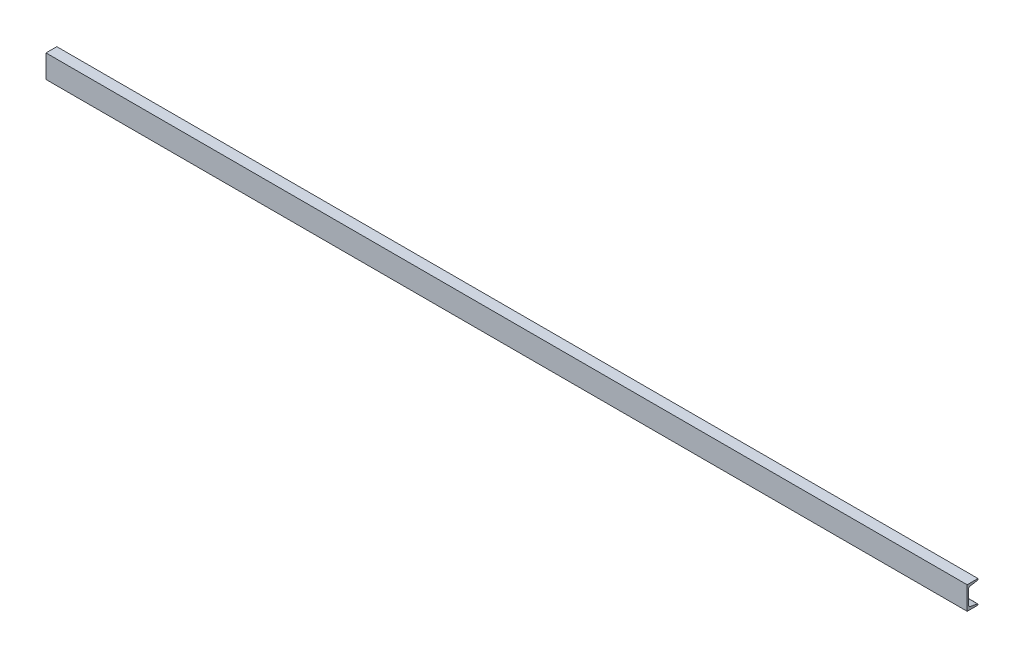
ISO-10303-21;
HEADER;
FILE_DESCRIPTION(('STEP AP214'),'2;1');
FILE_NAME('part.step','',(''),(''),'','','');
FILE_SCHEMA(('AUTOMOTIVE_DESIGN { 1 0 10303 214 1 1 1 1 }'));
ENDSEC;
DATA;
#1=APPLICATION_CONTEXT('core data for automotive mechanical design processes');
#2=APPLICATION_PROTOCOL_DEFINITION('international standard','automotive_design',2000,#1);
#3=PRODUCT_CONTEXT('',#1,'mechanical');
#4=PRODUCT('Part','Part','',(#3));
#5=PRODUCT_RELATED_PRODUCT_CATEGORY('part','',(#4));
#6=PRODUCT_DEFINITION_FORMATION('','',#4);
#7=PRODUCT_DEFINITION_CONTEXT('part definition',#1,'design');
#8=PRODUCT_DEFINITION('design','',#6,#7);
#9=PRODUCT_DEFINITION_SHAPE('','',#8);
#10=(LENGTH_UNIT() NAMED_UNIT(*) SI_UNIT(.MILLI.,.METRE.));
#11=(NAMED_UNIT(*) PLANE_ANGLE_UNIT() SI_UNIT($,.RADIAN.));
#12=(NAMED_UNIT(*) SI_UNIT($,.STERADIAN.) SOLID_ANGLE_UNIT());
#13=UNCERTAINTY_MEASURE_WITH_UNIT(LENGTH_MEASURE(1.E-05),#10,'distance_accuracy_value','');
#14=(GEOMETRIC_REPRESENTATION_CONTEXT(3) GLOBAL_UNCERTAINTY_ASSIGNED_CONTEXT((#13)) GLOBAL_UNIT_ASSIGNED_CONTEXT((#10,
#11,#12)) REPRESENTATION_CONTEXT('',''));
#15=CARTESIAN_POINT('',(0.,0.,0.));
#16=DIRECTION('',(0.,0.,1.));
#17=DIRECTION('',(1.,0.,0.));
#18=AXIS2_PLACEMENT_3D('',#15,#16,#17);
#19=CARTESIAN_POINT('',(3048.,-38.1,0.));
#20=DIRECTION('',(0.,1.,0.));
#21=DIRECTION('',(0.,0.,1.));
#22=AXIS2_PLACEMENT_3D('',#19,#20,#21);
#23=PLANE('',#22);
#24=DIRECTION('',(0.,0.,-1.));
#25=VECTOR('',#24,1.);
#26=CARTESIAN_POINT('',(0.,-38.1,0.));
#27=LINE('',#26,#25);
#28=CARTESIAN_POINT('',(0.,-38.1,0.));
#29=VERTEX_POINT('',#28);
#30=CARTESIAN_POINT('',(0.,-38.1,-35.814));
#31=VERTEX_POINT('',#30);
#32=EDGE_CURVE('E194',#29,#31,#27,.T.);
#33=ORIENTED_EDGE('',*,*,#32,.T.);
#34=DIRECTION('',(-1.,0.,0.));
#35=VECTOR('',#34,1.);
#36=CARTESIAN_POINT('',(3048.,-38.1,-35.814));
#37=LINE('',#36,#35);
#38=CARTESIAN_POINT('',(3048.,-38.1,-35.814));
#39=VERTEX_POINT('',#38);
#40=EDGE_CURVE('E13',#39,#31,#37,.T.);
#41=ORIENTED_EDGE('',*,*,#40,.F.);
#42=DIRECTION('',(0.,0.,-1.));
#43=VECTOR('',#42,1.);
#44=CARTESIAN_POINT('',(3048.,-38.1,0.));
#45=LINE('',#44,#43);
#46=CARTESIAN_POINT('',(3048.,-38.1,0.));
#47=VERTEX_POINT('',#46);
#48=EDGE_CURVE('E216',#47,#39,#45,.T.);
#49=ORIENTED_EDGE('',*,*,#48,.F.);
#50=DIRECTION('',(-1.,0.,0.));
#51=VECTOR('',#50,1.);
#52=CARTESIAN_POINT('',(3048.,-38.1,0.));
#53=LINE('',#52,#51);
#54=EDGE_CURVE('E190',#47,#29,#53,.T.);
#55=ORIENTED_EDGE('',*,*,#54,.T.);
#56=EDGE_LOOP('',(#33,#41,#49,#55));
#57=FACE_BOUND('',#56,.T.);
#58=ADVANCED_FACE('F74',(#57),#23,.F.);
#59=CARTESIAN_POINT('',(3048.,-38.1,-35.814));
#60=DIRECTION('',(0.,0.,1.));
#61=DIRECTION('',(1.,0.,0.));
#62=AXIS2_PLACEMENT_3D('',#59,#60,#61);
#63=PLANE('',#62);
#64=DIRECTION('',(0.,1.,0.));
#65=VECTOR('',#64,1.);
#66=CARTESIAN_POINT('',(0.,-38.1,-35.814));
#67=LINE('',#66,#65);
#68=CARTESIAN_POINT('',(0.,-35.942335135838,-35.814));
#69=VERTEX_POINT('',#68);
#70=EDGE_CURVE('E197',#31,#69,#67,.T.);
#71=ORIENTED_EDGE('',*,*,#70,.T.);
#72=DIRECTION('',(-1.,0.,0.));
#73=VECTOR('',#72,1.);
#74=CARTESIAN_POINT('',(3048.,-35.942335135838,-35.814));
#75=LINE('',#74,#73);
#76=CARTESIAN_POINT('',(3048.,-35.942335135838,-35.814));
#77=VERTEX_POINT('',#76);
#78=EDGE_CURVE('E82',#77,#69,#75,.T.);
#79=ORIENTED_EDGE('',*,*,#78,.F.);
#80=DIRECTION('',(0.,1.,0.));
#81=VECTOR('',#80,1.);
#82=CARTESIAN_POINT('',(3048.,-38.1,-35.814));
#83=LINE('',#82,#81);
#84=EDGE_CURVE('E145',#39,#77,#83,.T.);
#85=ORIENTED_EDGE('',*,*,#84,.F.);
#86=ORIENTED_EDGE('',*,*,#40,.T.);
#87=EDGE_LOOP('',(#71,#79,#85,#86));
#88=FACE_BOUND('',#87,.T.);
#89=ADVANCED_FACE('F294',(#88),#63,.F.);
#90=CARTESIAN_POINT('',(3048.,-35.942335135838,-33.274));
#91=DIRECTION('',(-1.,0.,0.));
#92=DIRECTION('',(0.,0.,1.));
#93=AXIS2_PLACEMENT_3D('',#90,#91,#92);
#94=CYLINDRICAL_SURFACE('',#93,2.54);
#95=CARTESIAN_POINT('',(0.,-35.942335135838,-33.274));
#96=DIRECTION('',(1.,0.,0.));
#97=DIRECTION('',(0.,0.,-1.));
#98=AXIS2_PLACEMENT_3D('',#95,#96,#97);
#99=CIRCLE('',#98,2.54);
#100=CARTESIAN_POINT('',(0.,-33.4368995092487,-33.6916030663407));
#101=VERTEX_POINT('',#100);
#102=EDGE_CURVE('E199',#69,#101,#99,.T.);
#103=ORIENTED_EDGE('',*,*,#102,.T.);
#104=DIRECTION('',(-1.,0.,0.));
#105=VECTOR('',#104,1.);
#106=CARTESIAN_POINT('',(3048.,-33.4368995092487,-33.6916030663407));
#107=LINE('',#106,#105);
#108=CARTESIAN_POINT('',(3048.,-33.4368995092487,-33.6916030663407));
#109=VERTEX_POINT('',#108);
#110=EDGE_CURVE('E235',#109,#101,#107,.T.);
#111=ORIENTED_EDGE('',*,*,#110,.F.);
#112=CARTESIAN_POINT('',(3048.,-35.942335135838,-33.274));
#113=DIRECTION('',(1.,0.,0.));
#114=DIRECTION('',(0.,0.,-1.));
#115=AXIS2_PLACEMENT_3D('',#112,#113,#114);
#116=CIRCLE('',#115,2.54);
#117=EDGE_CURVE('E243',#77,#109,#116,.T.);
#118=ORIENTED_EDGE('',*,*,#117,.F.);
#119=ORIENTED_EDGE('',*,*,#78,.T.);
#120=EDGE_LOOP('',(#103,#111,#118,#119));
#121=FACE_BOUND('',#120,.T.);
#122=ADVANCED_FACE('F241',(#121),#94,.T.);
#123=CARTESIAN_POINT('',(3048.,-29.4960901573835,-10.0484717208802));
#124=DIRECTION('',(0.,-0.986391978972162,0.164410656039631));
#125=DIRECTION('',(0.,-0.164410656039631,-0.986391978972162));
#126=AXIS2_PLACEMENT_3D('',#123,#124,#125);
#127=PLANE('',#126);
#128=DIRECTION('',(0.,0.164410656039631,0.986391978972162));
#129=VECTOR('',#128,1.);
#130=CARTESIAN_POINT('',(0.,-29.4960901573835,-10.0484717208802));
#131=LINE('',#130,#129);
#132=CARTESIAN_POINT('',(0.,-29.4960901573835,-10.0484717208802));
#133=VERTEX_POINT('',#132);
#134=EDGE_CURVE('E201',#101,#133,#131,.T.);
#135=ORIENTED_EDGE('',*,*,#134,.T.);
#136=DIRECTION('',(-1.,0.,0.));
#137=VECTOR('',#136,1.);
#138=CARTESIAN_POINT('',(3048.,-29.4960901573835,-10.0484717208802));
#139=LINE('',#138,#137);
#140=CARTESIAN_POINT('',(3048.,-29.4960901573835,-10.0484717208802));
#141=VERTEX_POINT('',#140);
#142=EDGE_CURVE('E232',#141,#133,#139,.T.);
#143=ORIENTED_EDGE('',*,*,#142,.F.);
#144=DIRECTION('',(0.,0.164410656039631,0.986391978972162));
#145=VECTOR('',#144,1.);
#146=CARTESIAN_POINT('',(3048.,-29.4960901573835,-10.0484717208802));
#147=LINE('',#146,#145);
#148=EDGE_CURVE('E261',#109,#141,#147,.T.);
#149=ORIENTED_EDGE('',*,*,#148,.F.);
#150=ORIENTED_EDGE('',*,*,#110,.T.);
#151=EDGE_LOOP('',(#135,#143,#149,#150));
#152=FACE_BOUND('',#151,.T.);
#153=ADVANCED_FACE('F252',(#152),#127,.F.);
#154=CARTESIAN_POINT('',(3048.,-22.7314139655924,-11.176));
#155=DIRECTION('',(-1.,0.,0.));
#156=DIRECTION('',(0.,0.,1.));
#157=AXIS2_PLACEMENT_3D('',#154,#155,#156);
#158=CYLINDRICAL_SURFACE('',#157,6.858);
#159=CARTESIAN_POINT('',(0.,-22.7314139655924,-11.176));
#160=DIRECTION('',(-1.,0.,0.));
#161=DIRECTION('',(0.,0.,-1.));
#162=AXIS2_PLACEMENT_3D('',#159,#160,#161);
#163=CIRCLE('',#162,6.858);
#164=CARTESIAN_POINT('',(0.,-22.7314139655924,-4.318));
#165=VERTEX_POINT('',#164);
#166=EDGE_CURVE('E203',#133,#165,#163,.T.);
#167=ORIENTED_EDGE('',*,*,#166,.T.);
#168=DIRECTION('',(-1.,0.,0.));
#169=VECTOR('',#168,1.);
#170=CARTESIAN_POINT('',(3048.,-22.7314139655924,-4.318));
#171=LINE('',#170,#169);
#172=CARTESIAN_POINT('',(3048.,-22.7314139655924,-4.318));
#173=VERTEX_POINT('',#172);
#174=EDGE_CURVE('E229',#173,#165,#171,.T.);
#175=ORIENTED_EDGE('',*,*,#174,.F.);
#176=CARTESIAN_POINT('',(3048.,-22.7314139655924,-11.176));
#177=DIRECTION('',(-1.,0.,0.));
#178=DIRECTION('',(0.,0.,-1.));
#179=AXIS2_PLACEMENT_3D('',#176,#177,#178);
#180=CIRCLE('',#179,6.858);
#181=EDGE_CURVE('E258',#141,#173,#180,.T.);
#182=ORIENTED_EDGE('',*,*,#181,.F.);
#183=ORIENTED_EDGE('',*,*,#142,.T.);
#184=EDGE_LOOP('',(#167,#175,#182,#183));
#185=FACE_BOUND('',#184,.T.);
#186=ADVANCED_FACE('F256',(#185),#158,.F.);
#187=CARTESIAN_POINT('',(3048.,22.7314139655925,-4.318));
#188=DIRECTION('',(0.,0.,1.));
#189=DIRECTION('',(0.,-1.,0.));
#190=AXIS2_PLACEMENT_3D('',#187,#188,#189);
#191=PLANE('',#190);
#192=DIRECTION('',(0.,1.,0.));
#193=VECTOR('',#192,1.);
#194=CARTESIAN_POINT('',(0.,22.7314139655925,-4.318));
#195=LINE('',#194,#193);
#196=CARTESIAN_POINT('',(0.,22.7314139655925,-4.31799999999999));
#197=VERTEX_POINT('',#196);
#198=EDGE_CURVE('E205',#165,#197,#195,.T.);
#199=ORIENTED_EDGE('',*,*,#198,.T.);
#200=DIRECTION('',(-1.,0.,0.));
#201=VECTOR('',#200,1.);
#202=CARTESIAN_POINT('',(3048.,22.7314139655925,-4.31799999999999));
#203=LINE('',#202,#201);
#204=CARTESIAN_POINT('',(3048.,22.7314139655925,-4.31799999999999));
#205=VERTEX_POINT('',#204);
#206=EDGE_CURVE('E226',#205,#197,#203,.T.);
#207=ORIENTED_EDGE('',*,*,#206,.F.);
#208=DIRECTION('',(0.,1.,0.));
#209=VECTOR('',#208,1.);
#210=CARTESIAN_POINT('',(3048.,22.7314139655925,-4.318));
#211=LINE('',#210,#209);
#212=EDGE_CURVE('E260',#173,#205,#211,.T.);
#213=ORIENTED_EDGE('',*,*,#212,.F.);
#214=ORIENTED_EDGE('',*,*,#174,.T.);
#215=EDGE_LOOP('',(#199,#207,#213,#214));
#216=FACE_BOUND('',#215,.T.);
#217=ADVANCED_FACE('F307',(#216),#191,.F.);
#218=CARTESIAN_POINT('',(3048.,22.7314139655925,-11.176));
#219=DIRECTION('',(-1.,0.,0.));
#220=DIRECTION('',(0.,0.,1.));
#221=AXIS2_PLACEMENT_3D('',#218,#219,#220);
#222=CYLINDRICAL_SURFACE('',#221,6.858);
#223=CARTESIAN_POINT('',(0.,22.7314139655925,-11.176));
#224=DIRECTION('',(-1.,0.,0.));
#225=DIRECTION('',(0.,0.,1.));
#226=AXIS2_PLACEMENT_3D('',#223,#224,#225);
#227=CIRCLE('',#226,6.858);
#228=CARTESIAN_POINT('',(0.,29.4960901573836,-10.0484717208802));
#229=VERTEX_POINT('',#228);
#230=EDGE_CURVE('E207',#197,#229,#227,.T.);
#231=ORIENTED_EDGE('',*,*,#230,.T.);
#232=DIRECTION('',(-1.,0.,0.));
#233=VECTOR('',#232,1.);
#234=CARTESIAN_POINT('',(3048.,29.4960901573836,-10.0484717208802));
#235=LINE('',#234,#233);
#236=CARTESIAN_POINT('',(3048.,29.4960901573836,-10.0484717208802));
#237=VERTEX_POINT('',#236);
#238=EDGE_CURVE('E223',#237,#229,#235,.T.);
#239=ORIENTED_EDGE('',*,*,#238,.F.);
#240=CARTESIAN_POINT('',(3048.,22.7314139655925,-11.176));
#241=DIRECTION('',(-1.,0.,0.));
#242=DIRECTION('',(0.,0.,1.));
#243=AXIS2_PLACEMENT_3D('',#240,#241,#242);
#244=CIRCLE('',#243,6.858);
#245=EDGE_CURVE('E263',#205,#237,#244,.T.);
#246=ORIENTED_EDGE('',*,*,#245,.F.);
#247=ORIENTED_EDGE('',*,*,#206,.T.);
#248=EDGE_LOOP('',(#231,#239,#246,#247));
#249=FACE_BOUND('',#248,.T.);
#250=ADVANCED_FACE('F310',(#249),#222,.F.);
#251=CARTESIAN_POINT('',(3048.,29.4960901573836,-10.0484717208802));
#252=DIRECTION('',(0.,0.986391978972162,0.16441065603963));
#253=DIRECTION('',(0.,-0.16441065603963,0.986391978972162));
#254=AXIS2_PLACEMENT_3D('',#251,#252,#253);
#255=PLANE('',#254);
#256=DIRECTION('',(0.,0.16441065603963,-0.986391978972162));
#257=VECTOR('',#256,1.);
#258=CARTESIAN_POINT('',(0.,29.4960901573836,-10.0484717208802));
#259=LINE('',#258,#257);
#260=CARTESIAN_POINT('',(0.,33.4368995092487,-33.6916030663407));
#261=VERTEX_POINT('',#260);
#262=EDGE_CURVE('E209',#229,#261,#259,.T.);
#263=ORIENTED_EDGE('',*,*,#262,.T.);
#264=DIRECTION('',(-1.,0.,0.));
#265=VECTOR('',#264,1.);
#266=CARTESIAN_POINT('',(3048.,33.4368995092487,-33.6916030663407));
#267=LINE('',#266,#265);
#268=CARTESIAN_POINT('',(3048.,33.4368995092487,-33.6916030663407));
#269=VERTEX_POINT('',#268);
#270=EDGE_CURVE('E220',#269,#261,#267,.T.);
#271=ORIENTED_EDGE('',*,*,#270,.F.);
#272=DIRECTION('',(0.,0.16441065603963,-0.986391978972162));
#273=VECTOR('',#272,1.);
#274=CARTESIAN_POINT('',(3048.,29.4960901573836,-10.0484717208802));
#275=LINE('',#274,#273);
#276=EDGE_CURVE('E269',#237,#269,#275,.T.);
#277=ORIENTED_EDGE('',*,*,#276,.F.);
#278=ORIENTED_EDGE('',*,*,#238,.T.);
#279=EDGE_LOOP('',(#263,#271,#277,#278));
#280=FACE_BOUND('',#279,.T.);
#281=ADVANCED_FACE('F275',(#280),#255,.F.);
#282=CARTESIAN_POINT('',(3048.,35.942335135838,-33.274));
#283=DIRECTION('',(-1.,0.,0.));
#284=DIRECTION('',(0.,0.,1.));
#285=AXIS2_PLACEMENT_3D('',#282,#283,#284);
#286=CYLINDRICAL_SURFACE('',#285,2.54);
#287=CARTESIAN_POINT('',(0.,35.942335135838,-33.274));
#288=DIRECTION('',(1.,0.,0.));
#289=DIRECTION('',(0.,0.,1.));
#290=AXIS2_PLACEMENT_3D('',#287,#288,#289);
#291=CIRCLE('',#290,2.54);
#292=CARTESIAN_POINT('',(0.,35.942335135838,-35.814));
#293=VERTEX_POINT('',#292);
#294=EDGE_CURVE('E211',#261,#293,#291,.T.);
#295=ORIENTED_EDGE('',*,*,#294,.T.);
#296=DIRECTION('',(-1.,0.,0.));
#297=VECTOR('',#296,1.);
#298=CARTESIAN_POINT('',(3048.,35.942335135838,-35.814));
#299=LINE('',#298,#297);
#300=CARTESIAN_POINT('',(3048.,35.942335135838,-35.814));
#301=VERTEX_POINT('',#300);
#302=EDGE_CURVE('E185',#301,#293,#299,.T.);
#303=ORIENTED_EDGE('',*,*,#302,.F.);
#304=CARTESIAN_POINT('',(3048.,35.942335135838,-33.274));
#305=DIRECTION('',(1.,0.,0.));
#306=DIRECTION('',(0.,0.,1.));
#307=AXIS2_PLACEMENT_3D('',#304,#305,#306);
#308=CIRCLE('',#307,2.54);
#309=EDGE_CURVE('E176',#269,#301,#308,.T.);
#310=ORIENTED_EDGE('',*,*,#309,.F.);
#311=ORIENTED_EDGE('',*,*,#270,.T.);
#312=EDGE_LOOP('',(#295,#303,#310,#311));
#313=FACE_BOUND('',#312,.T.);
#314=ADVANCED_FACE('F279',(#313),#286,.T.);
#315=CARTESIAN_POINT('',(3048.,38.1,-35.814));
#316=DIRECTION('',(0.,0.,1.));
#317=DIRECTION('',(0.,-1.,0.));
#318=AXIS2_PLACEMENT_3D('',#315,#316,#317);
#319=PLANE('',#318);
#320=DIRECTION('',(0.,1.,0.));
#321=VECTOR('',#320,1.);
#322=CARTESIAN_POINT('',(0.,38.1,-35.814));
#323=LINE('',#322,#321);
#324=CARTESIAN_POINT('',(0.,38.1,-35.814));
#325=VERTEX_POINT('',#324);
#326=EDGE_CURVE('E184',#293,#325,#323,.T.);
#327=ORIENTED_EDGE('',*,*,#326,.T.);
#328=DIRECTION('',(-1.,0.,0.));
#329=VECTOR('',#328,1.);
#330=CARTESIAN_POINT('',(3048.,38.1,-35.814));
#331=LINE('',#330,#329);
#332=CARTESIAN_POINT('',(3048.,38.1,-35.814));
#333=VERTEX_POINT('',#332);
#334=EDGE_CURVE('E181',#333,#325,#331,.T.);
#335=ORIENTED_EDGE('',*,*,#334,.F.);
#336=DIRECTION('',(0.,1.,0.));
#337=VECTOR('',#336,1.);
#338=CARTESIAN_POINT('',(3048.,38.1,-35.814));
#339=LINE('',#338,#337);
#340=EDGE_CURVE('E170',#301,#333,#339,.T.);
#341=ORIENTED_EDGE('',*,*,#340,.F.);
#342=ORIENTED_EDGE('',*,*,#302,.T.);
#343=EDGE_LOOP('',(#327,#335,#341,#342));
#344=FACE_BOUND('',#343,.T.);
#345=ADVANCED_FACE('F182',(#344),#319,.F.);
#346=CARTESIAN_POINT('',(3048.,38.1,0.));
#347=DIRECTION('',(0.,-1.,0.));
#348=DIRECTION('',(0.,0.,-1.));
#349=AXIS2_PLACEMENT_3D('',#346,#347,#348);
#350=PLANE('',#349);
#351=DIRECTION('',(0.,0.,1.));
#352=VECTOR('',#351,1.);
#353=CARTESIAN_POINT('',(0.,38.1,0.));
#354=LINE('',#353,#352);
#355=CARTESIAN_POINT('',(0.,38.1,0.));
#356=VERTEX_POINT('',#355);
#357=EDGE_CURVE('E131',#325,#356,#354,.T.);
#358=ORIENTED_EDGE('',*,*,#357,.T.);
#359=DIRECTION('',(-1.,0.,0.));
#360=VECTOR('',#359,1.);
#361=CARTESIAN_POINT('',(3048.,38.1,0.));
#362=LINE('',#361,#360);
#363=CARTESIAN_POINT('',(3048.,38.1,0.));
#364=VERTEX_POINT('',#363);
#365=EDGE_CURVE('E186',#364,#356,#362,.T.);
#366=ORIENTED_EDGE('',*,*,#365,.F.);
#367=DIRECTION('',(0.,0.,1.));
#368=VECTOR('',#367,1.);
#369=CARTESIAN_POINT('',(3048.,38.1,0.));
#370=LINE('',#369,#368);
#371=EDGE_CURVE('E174',#333,#364,#370,.T.);
#372=ORIENTED_EDGE('',*,*,#371,.F.);
#373=ORIENTED_EDGE('',*,*,#334,.T.);
#374=EDGE_LOOP('',(#358,#366,#372,#373));
#375=FACE_BOUND('',#374,.T.);
#376=ADVANCED_FACE('F188',(#375),#350,.F.);
#377=CARTESIAN_POINT('',(3048.,-38.1,0.));
#378=DIRECTION('',(0.,0.,-1.));
#379=DIRECTION('',(-1.,0.,0.));
#380=AXIS2_PLACEMENT_3D('',#377,#378,#379);
#381=PLANE('',#380);
#382=DIRECTION('',(0.,-1.,0.));
#383=VECTOR('',#382,1.);
#384=CARTESIAN_POINT('',(0.,-38.1,0.));
#385=LINE('',#384,#383);
#386=EDGE_CURVE('E137',#356,#29,#385,.T.);
#387=ORIENTED_EDGE('',*,*,#386,.T.);
#388=ORIENTED_EDGE('',*,*,#54,.F.);
#389=DIRECTION('',(0.,-1.,0.));
#390=VECTOR('',#389,1.);
#391=CARTESIAN_POINT('',(3048.,-38.1,0.));
#392=LINE('',#391,#390);
#393=EDGE_CURVE('E90',#364,#47,#392,.T.);
#394=ORIENTED_EDGE('',*,*,#393,.F.);
#395=ORIENTED_EDGE('',*,*,#365,.T.);
#396=EDGE_LOOP('',(#387,#388,#394,#395));
#397=FACE_BOUND('',#396,.T.);
#398=ADVANCED_FACE('F283',(#397),#381,.F.);
#399=CARTESIAN_POINT('',(3048.,-35.942335135838,-33.274));
#400=DIRECTION('',(1.,0.,0.));
#401=DIRECTION('',(0.,0.,-1.));
#402=AXIS2_PLACEMENT_3D('',#399,#400,#401);
#403=PLANE('',#402);
#404=ORIENTED_EDGE('',*,*,#48,.T.);
#405=ORIENTED_EDGE('',*,*,#84,.T.);
#406=ORIENTED_EDGE('',*,*,#117,.T.);
#407=ORIENTED_EDGE('',*,*,#148,.T.);
#408=ORIENTED_EDGE('',*,*,#181,.T.);
#409=ORIENTED_EDGE('',*,*,#212,.T.);
#410=ORIENTED_EDGE('',*,*,#245,.T.);
#411=ORIENTED_EDGE('',*,*,#276,.T.);
#412=ORIENTED_EDGE('',*,*,#309,.T.);
#413=ORIENTED_EDGE('',*,*,#340,.T.);
#414=ORIENTED_EDGE('',*,*,#371,.T.);
#415=ORIENTED_EDGE('',*,*,#393,.T.);
#416=EDGE_LOOP('',(#404,#405,#406,#407,#408,#409,#410,#411,#412,#413,#414,#415));
#417=FACE_BOUND('',#416,.T.);
#418=ADVANCED_FACE('F172',(#417),#403,.T.);
#419=CARTESIAN_POINT('',(0.,-35.942335135838,-33.274));
#420=DIRECTION('',(1.,0.,0.));
#421=DIRECTION('',(0.,0.,-1.));
#422=AXIS2_PLACEMENT_3D('',#419,#420,#421);
#423=PLANE('',#422);
#424=ORIENTED_EDGE('',*,*,#32,.F.);
#425=ORIENTED_EDGE('',*,*,#386,.F.);
#426=ORIENTED_EDGE('',*,*,#357,.F.);
#427=ORIENTED_EDGE('',*,*,#326,.F.);
#428=ORIENTED_EDGE('',*,*,#294,.F.);
#429=ORIENTED_EDGE('',*,*,#262,.F.);
#430=ORIENTED_EDGE('',*,*,#230,.F.);
#431=ORIENTED_EDGE('',*,*,#198,.F.);
#432=ORIENTED_EDGE('',*,*,#166,.F.);
#433=ORIENTED_EDGE('',*,*,#134,.F.);
#434=ORIENTED_EDGE('',*,*,#102,.F.);
#435=ORIENTED_EDGE('',*,*,#70,.F.);
#436=EDGE_LOOP('',(#424,#425,#426,#427,#428,#429,#430,#431,#432,#433,#434,#435));
#437=FACE_BOUND('',#436,.T.);
#438=ADVANCED_FACE('F247',(#437),#423,.F.);
#439=CLOSED_SHELL('',(#58,#89,#122,#153,#186,#217,#250,#281,#314,#345,#376,#398,#418,#438));
#440=MANIFOLD_SOLID_BREP('B2',#439);
#441=ADVANCED_BREP_SHAPE_REPRESENTATION('',(#18,#440),#14);
#442=SHAPE_DEFINITION_REPRESENTATION(#9,#441);
ENDSEC;
END-ISO-10303-21;
